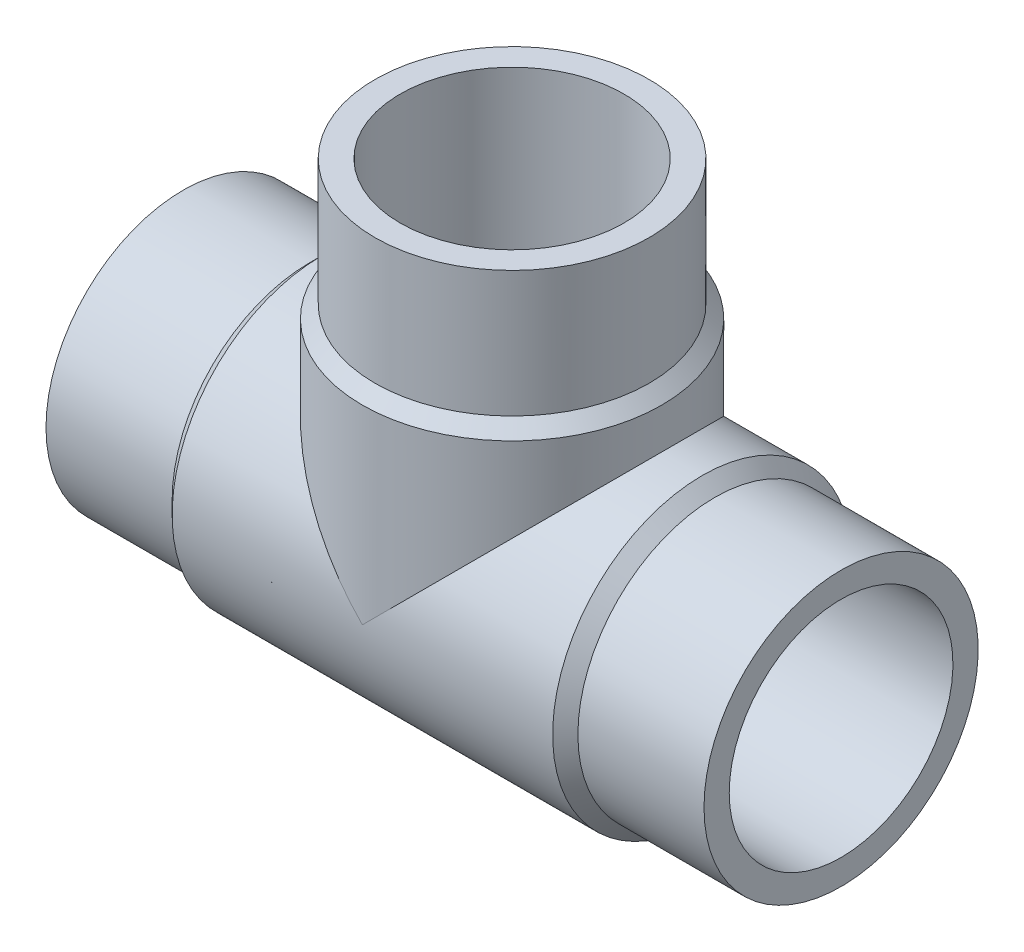
ISO-10303-21;
HEADER;
FILE_DESCRIPTION(('STEP AP214'),'2;1');
FILE_NAME('part.step','',(''),(''),'','','');
FILE_SCHEMA(('AUTOMOTIVE_DESIGN { 1 0 10303 214 1 1 1 1 }'));
ENDSEC;
DATA;
#1=APPLICATION_CONTEXT('core data for automotive mechanical design processes');
#2=APPLICATION_PROTOCOL_DEFINITION('international standard','automotive_design',2000,#1);
#3=PRODUCT_CONTEXT('',#1,'mechanical');
#4=PRODUCT('Part','Part','',(#3));
#5=PRODUCT_RELATED_PRODUCT_CATEGORY('part','',(#4));
#6=PRODUCT_DEFINITION_FORMATION('','',#4);
#7=PRODUCT_DEFINITION_CONTEXT('part definition',#1,'design');
#8=PRODUCT_DEFINITION('design','',#6,#7);
#9=PRODUCT_DEFINITION_SHAPE('','',#8);
#10=(LENGTH_UNIT() NAMED_UNIT(*) SI_UNIT(.MILLI.,.METRE.));
#11=(NAMED_UNIT(*) PLANE_ANGLE_UNIT() SI_UNIT($,.RADIAN.));
#12=(NAMED_UNIT(*) SI_UNIT($,.STERADIAN.) SOLID_ANGLE_UNIT());
#13=UNCERTAINTY_MEASURE_WITH_UNIT(LENGTH_MEASURE(1.E-05),#10,'distance_accuracy_value','');
#14=(GEOMETRIC_REPRESENTATION_CONTEXT(3) GLOBAL_UNCERTAINTY_ASSIGNED_CONTEXT((#13)) GLOBAL_UNIT_ASSIGNED_CONTEXT((#10,
#11,#12)) REPRESENTATION_CONTEXT('',''));
#15=CARTESIAN_POINT('',(0.,0.,0.));
#16=DIRECTION('',(0.,0.,1.));
#17=DIRECTION('',(1.,0.,0.));
#18=AXIS2_PLACEMENT_3D('',#15,#16,#17);
#19=CARTESIAN_POINT('',(-60.,60.,0.));
#20=DIRECTION('',(0.,1.,0.));
#21=DIRECTION('',(0.,0.,1.));
#22=AXIS2_PLACEMENT_3D('',#19,#20,#21);
#23=CYLINDRICAL_SURFACE('',#22,25.);
#24=CARTESIAN_POINT('',(-60.,60.,0.));
#25=DIRECTION('',(0.,1.,0.));
#26=DIRECTION('',(0.,0.,1.));
#27=AXIS2_PLACEMENT_3D('',#24,#25,#26);
#28=CIRCLE('',#27,25.);
#29=CARTESIAN_POINT('',(-60.,60.,25.));
#30=VERTEX_POINT('',#29);
#31=EDGE_CURVE('E18',#30,#30,#28,.T.);
#32=ORIENTED_EDGE('',*,*,#31,.F.);
#33=EDGE_LOOP('',(#32));
#34=FACE_BOUND('',#33,.T.);
#35=CARTESIAN_POINT('',(-60.,37.,0.));
#36=DIRECTION('',(0.,1.,0.));
#37=DIRECTION('',(1.,0.,0.));
#38=AXIS2_PLACEMENT_3D('',#35,#36,#37);
#39=CIRCLE('',#38,25.);
#40=CARTESIAN_POINT('',(-35.,37.,0.));
#41=VERTEX_POINT('',#40);
#42=EDGE_CURVE('E71',#41,#41,#39,.F.);
#43=ORIENTED_EDGE('',*,*,#42,.F.);
#44=EDGE_LOOP('',(#43));
#45=FACE_BOUND('',#44,.T.);
#46=ADVANCED_FACE('F15',(#34,#45),#23,.T.);
#47=CARTESIAN_POINT('',(-60.,37.,0.));
#48=DIRECTION('',(0.,-1.,0.));
#49=DIRECTION('',(0.,0.,-1.));
#50=AXIS2_PLACEMENT_3D('',#47,#48,#49);
#51=CONICAL_SURFACE('',#50,25.,0.785398163397448);
#52=CARTESIAN_POINT('',(-60.,34.7,0.));
#53=DIRECTION('',(0.,1.,0.));
#54=DIRECTION('',(1.,0.,0.));
#55=AXIS2_PLACEMENT_3D('',#52,#53,#54);
#56=CIRCLE('',#55,27.3);
#57=CARTESIAN_POINT('',(-32.7,34.7,0.));
#58=VERTEX_POINT('',#57);
#59=EDGE_CURVE('E60',#58,#58,#56,.F.);
#60=ORIENTED_EDGE('',*,*,#59,.F.);
#61=EDGE_LOOP('',(#60));
#62=FACE_BOUND('',#61,.T.);
#63=ORIENTED_EDGE('',*,*,#42,.T.);
#64=EDGE_LOOP('',(#63));
#65=FACE_BOUND('',#64,.T.);
#66=ADVANCED_FACE('F141',(#62,#65),#51,.T.);
#67=CARTESIAN_POINT('',(-23.,0.,0.));
#68=DIRECTION('',(-1.,0.,0.));
#69=DIRECTION('',(0.,0.,1.));
#70=AXIS2_PLACEMENT_3D('',#67,#68,#69);
#71=CYLINDRICAL_SURFACE('',#70,25.);
#72=CARTESIAN_POINT('',(-23.,0.,0.));
#73=DIRECTION('',(1.,0.,0.));
#74=DIRECTION('',(0.,1.,0.));
#75=AXIS2_PLACEMENT_3D('',#72,#73,#74);
#76=CIRCLE('',#75,25.);
#77=CARTESIAN_POINT('',(-23.,25.,0.));
#78=VERTEX_POINT('',#77);
#79=EDGE_CURVE('E64',#78,#78,#76,.F.);
#80=ORIENTED_EDGE('',*,*,#79,.F.);
#81=EDGE_LOOP('',(#80));
#82=FACE_BOUND('',#81,.T.);
#83=CARTESIAN_POINT('',(0.,0.,0.));
#84=DIRECTION('',(-1.,0.,0.));
#85=DIRECTION('',(0.,0.,1.));
#86=AXIS2_PLACEMENT_3D('',#83,#84,#85);
#87=CIRCLE('',#86,25.);
#88=CARTESIAN_POINT('',(0.,0.,25.));
#89=VERTEX_POINT('',#88);
#90=EDGE_CURVE('E58',#89,#89,#87,.F.);
#91=ORIENTED_EDGE('',*,*,#90,.F.);
#92=EDGE_LOOP('',(#91));
#93=FACE_BOUND('',#92,.T.);
#94=ADVANCED_FACE('F136',(#82,#93),#71,.T.);
#95=CARTESIAN_POINT('',(-85.,60.,25.3000021082717));
#96=DIRECTION('',(0.,1.,0.));
#97=DIRECTION('',(1.,0.,0.));
#98=AXIS2_PLACEMENT_3D('',#95,#96,#97);
#99=PLANE('',#98);
#100=CARTESIAN_POINT('',(-60.,60.,0.));
#101=DIRECTION('',(0.,1.,0.));
#102=DIRECTION('',(0.,0.,1.));
#103=AXIS2_PLACEMENT_3D('',#100,#101,#102);
#104=CIRCLE('',#103,20.4);
#105=CARTESIAN_POINT('',(-60.,60.,20.4));
#106=VERTEX_POINT('',#105);
#107=EDGE_CURVE('E52',#106,#106,#104,.T.);
#108=ORIENTED_EDGE('',*,*,#107,.F.);
#109=EDGE_LOOP('',(#108));
#110=FACE_BOUND('',#109,.T.);
#111=ORIENTED_EDGE('',*,*,#31,.T.);
#112=EDGE_LOOP('',(#111));
#113=FACE_BOUND('',#112,.T.);
#114=ADVANCED_FACE('F130',(#110,#113),#99,.T.);
#115=CARTESIAN_POINT('',(-23.,0.,0.));
#116=DIRECTION('',(-1.,0.,0.));
#117=DIRECTION('',(0.,0.,1.));
#118=AXIS2_PLACEMENT_3D('',#115,#116,#117);
#119=CONICAL_SURFACE('',#118,25.,0.785398163397452);
#120=ORIENTED_EDGE('',*,*,#79,.T.);
#121=EDGE_LOOP('',(#120));
#122=FACE_BOUND('',#121,.T.);
#123=CARTESIAN_POINT('',(-25.3,0.,0.));
#124=DIRECTION('',(-1.,0.,0.));
#125=DIRECTION('',(0.,1.,0.));
#126=AXIS2_PLACEMENT_3D('',#123,#124,#125);
#127=CIRCLE('',#126,27.3);
#128=CARTESIAN_POINT('',(-25.3,27.3,0.));
#129=VERTEX_POINT('',#128);
#130=EDGE_CURVE('E49',#129,#129,#127,.T.);
#131=ORIENTED_EDGE('',*,*,#130,.F.);
#132=EDGE_LOOP('',(#131));
#133=FACE_BOUND('',#132,.T.);
#134=ADVANCED_FACE('F95',(#122,#133),#119,.T.);
#135=CARTESIAN_POINT('',(-60.,34.7,0.));
#136=DIRECTION('',(0.,1.,0.));
#137=DIRECTION('',(0.,0.,1.));
#138=AXIS2_PLACEMENT_3D('',#135,#136,#137);
#139=CYLINDRICAL_SURFACE('',#138,27.3);
#140=CARTESIAN_POINT('',(-60.,0.,0.));
#141=DIRECTION('',(0.707106781186547,0.707106781186547,0.));
#142=DIRECTION('',(-0.707106781186547,0.707106781186547,0.));
#143=AXIS2_PLACEMENT_3D('',#140,#141,#142);
#144=ELLIPSE('',#143,38.6080302527855,27.3);
#145=CARTESIAN_POINT('',(-60.,0.,27.3));
#146=VERTEX_POINT('',#145);
#147=CARTESIAN_POINT('',(-60.,0.,-27.3));
#148=VERTEX_POINT('',#147);
#149=EDGE_CURVE('E44',#146,#148,#144,.F.);
#150=ORIENTED_EDGE('',*,*,#149,.F.);
#151=CARTESIAN_POINT('',(-60.,0.,0.));
#152=DIRECTION('',(-0.707106781186547,0.707106781186547,0.));
#153=DIRECTION('',(-0.707106781186547,-0.707106781186547,0.));
#154=AXIS2_PLACEMENT_3D('',#151,#152,#153);
#155=ELLIPSE('',#154,38.6080302527855,27.3);
#156=EDGE_CURVE('E40',#148,#146,#155,.F.);
#157=ORIENTED_EDGE('',*,*,#156,.F.);
#158=EDGE_LOOP('',(#150,#157));
#159=FACE_BOUND('',#158,.T.);
#160=ORIENTED_EDGE('',*,*,#59,.T.);
#161=EDGE_LOOP('',(#160));
#162=FACE_BOUND('',#161,.T.);
#163=ADVANCED_FACE('F47',(#159,#162),#139,.T.);
#164=CARTESIAN_POINT('',(0.,25.,25.3000021083545));
#165=DIRECTION('',(1.,0.,0.));
#166=DIRECTION('',(0.,-1.,0.));
#167=AXIS2_PLACEMENT_3D('',#164,#165,#166);
#168=PLANE('',#167);
#169=CARTESIAN_POINT('',(0.,0.,0.));
#170=DIRECTION('',(-1.,0.,0.));
#171=DIRECTION('',(0.,0.,1.));
#172=AXIS2_PLACEMENT_3D('',#169,#170,#171);
#173=CIRCLE('',#172,20.4);
#174=CARTESIAN_POINT('',(0.,0.,20.4));
#175=VERTEX_POINT('',#174);
#176=EDGE_CURVE('E45',#175,#175,#173,.F.);
#177=ORIENTED_EDGE('',*,*,#176,.F.);
#178=EDGE_LOOP('',(#177));
#179=FACE_BOUND('',#178,.T.);
#180=ORIENTED_EDGE('',*,*,#90,.T.);
#181=EDGE_LOOP('',(#180));
#182=FACE_BOUND('',#181,.T.);
#183=ADVANCED_FACE('F85',(#179,#182),#168,.T.);
#184=CARTESIAN_POINT('',(-60.,0.,0.));
#185=DIRECTION('',(0.,1.,0.));
#186=DIRECTION('',(0.,0.,1.));
#187=AXIS2_PLACEMENT_3D('',#184,#185,#186);
#188=CYLINDRICAL_SURFACE('',#187,20.4);
#189=CARTESIAN_POINT('',(-60.,0.,0.));
#190=DIRECTION('',(-0.707106781186547,-0.707106781186548,0.));
#191=DIRECTION('',(-0.707106781186548,0.707106781186547,0.));
#192=AXIS2_PLACEMENT_3D('',#189,#190,#191);
#193=ELLIPSE('',#192,28.8499566724111,20.4);
#194=CARTESIAN_POINT('',(-60.,0.,-20.4));
#195=VERTEX_POINT('',#194);
#196=CARTESIAN_POINT('',(-60.,0.,20.4));
#197=VERTEX_POINT('',#196);
#198=EDGE_CURVE('E78',#195,#197,#193,.F.);
#199=ORIENTED_EDGE('',*,*,#198,.F.);
#200=CARTESIAN_POINT('',(-60.,0.,0.));
#201=DIRECTION('',(-0.707106781186547,0.707106781186547,0.));
#202=DIRECTION('',(0.707106781186547,0.707106781186547,0.));
#203=AXIS2_PLACEMENT_3D('',#200,#201,#202);
#204=ELLIPSE('',#203,28.8499566724111,20.4);
#205=EDGE_CURVE('E32',#195,#197,#204,.F.);
#206=ORIENTED_EDGE('',*,*,#205,.T.);
#207=EDGE_LOOP('',(#199,#206));
#208=FACE_BOUND('',#207,.T.);
#209=ORIENTED_EDGE('',*,*,#107,.T.);
#210=EDGE_LOOP('',(#209));
#211=FACE_BOUND('',#210,.T.);
#212=ADVANCED_FACE('F87',(#208,#211),#188,.F.);
#213=CARTESIAN_POINT('',(-94.7,0.,0.));
#214=DIRECTION('',(-1.,0.,0.));
#215=DIRECTION('',(0.,0.,1.));
#216=AXIS2_PLACEMENT_3D('',#213,#214,#215);
#217=CYLINDRICAL_SURFACE('',#216,27.3);
#218=ORIENTED_EDGE('',*,*,#130,.T.);
#219=EDGE_LOOP('',(#218));
#220=FACE_BOUND('',#219,.T.);
#221=CARTESIAN_POINT('',(-94.7,0.,0.));
#222=DIRECTION('',(-1.,0.,0.));
#223=DIRECTION('',(0.,1.,0.));
#224=AXIS2_PLACEMENT_3D('',#221,#222,#223);
#225=CIRCLE('',#224,27.3);
#226=CARTESIAN_POINT('',(-94.7,27.3,0.));
#227=VERTEX_POINT('',#226);
#228=EDGE_CURVE('E77',#227,#227,#225,.T.);
#229=ORIENTED_EDGE('',*,*,#228,.F.);
#230=EDGE_LOOP('',(#229));
#231=FACE_BOUND('',#230,.T.);
#232=ORIENTED_EDGE('',*,*,#149,.T.);
#233=ORIENTED_EDGE('',*,*,#156,.T.);
#234=EDGE_LOOP('',(#232,#233));
#235=FACE_BOUND('',#234,.T.);
#236=ADVANCED_FACE('F43',(#220,#231,#235),#217,.T.);
#237=CARTESIAN_POINT('',(-60.,0.,0.));
#238=DIRECTION('',(-1.,0.,0.));
#239=DIRECTION('',(0.,-1.,0.));
#240=AXIS2_PLACEMENT_3D('',#237,#238,#239);
#241=CYLINDRICAL_SURFACE('',#240,20.4);
#242=ORIENTED_EDGE('',*,*,#205,.F.);
#243=ORIENTED_EDGE('',*,*,#198,.T.);
#244=EDGE_LOOP('',(#242,#243));
#245=FACE_BOUND('',#244,.T.);
#246=ORIENTED_EDGE('',*,*,#176,.T.);
#247=EDGE_LOOP('',(#246));
#248=FACE_BOUND('',#247,.T.);
#249=CARTESIAN_POINT('',(-120.,0.,0.));
#250=DIRECTION('',(-1.,0.,0.));
#251=DIRECTION('',(0.,-1.,0.));
#252=AXIS2_PLACEMENT_3D('',#249,#250,#251);
#253=CIRCLE('',#252,20.4);
#254=CARTESIAN_POINT('',(-120.,-20.4,0.));
#255=VERTEX_POINT('',#254);
#256=EDGE_CURVE('E74',#255,#255,#253,.F.);
#257=ORIENTED_EDGE('',*,*,#256,.F.);
#258=EDGE_LOOP('',(#257));
#259=FACE_BOUND('',#258,.T.);
#260=ADVANCED_FACE('F82',(#245,#248,#259),#241,.F.);
#261=CARTESIAN_POINT('',(-97.,0.,0.));
#262=DIRECTION('',(1.,0.,0.));
#263=DIRECTION('',(0.,0.,-1.));
#264=AXIS2_PLACEMENT_3D('',#261,#262,#263);
#265=CONICAL_SURFACE('',#264,25.,0.785398163397451);
#266=ORIENTED_EDGE('',*,*,#228,.T.);
#267=EDGE_LOOP('',(#266));
#268=FACE_BOUND('',#267,.T.);
#269=CARTESIAN_POINT('',(-97.,0.,0.));
#270=DIRECTION('',(-1.,0.,0.));
#271=DIRECTION('',(0.,1.,0.));
#272=AXIS2_PLACEMENT_3D('',#269,#270,#271);
#273=CIRCLE('',#272,25.);
#274=CARTESIAN_POINT('',(-97.,25.,0.));
#275=VERTEX_POINT('',#274);
#276=EDGE_CURVE('E24',#275,#275,#273,.T.);
#277=ORIENTED_EDGE('',*,*,#276,.F.);
#278=EDGE_LOOP('',(#277));
#279=FACE_BOUND('',#278,.T.);
#280=ADVANCED_FACE('F105',(#268,#279),#265,.T.);
#281=CARTESIAN_POINT('',(-120.,-25.,25.3000021084363));
#282=DIRECTION('',(-1.,0.,0.));
#283=DIRECTION('',(0.,1.,0.));
#284=AXIS2_PLACEMENT_3D('',#281,#282,#283);
#285=PLANE('',#284);
#286=ORIENTED_EDGE('',*,*,#256,.T.);
#287=EDGE_LOOP('',(#286));
#288=FACE_BOUND('',#287,.T.);
#289=CARTESIAN_POINT('',(-120.,0.,0.));
#290=DIRECTION('',(-1.,0.,0.));
#291=DIRECTION('',(0.,0.,1.));
#292=AXIS2_PLACEMENT_3D('',#289,#290,#291);
#293=CIRCLE('',#292,25.);
#294=CARTESIAN_POINT('',(-120.,0.,25.));
#295=VERTEX_POINT('',#294);
#296=EDGE_CURVE('E9',#295,#295,#293,.F.);
#297=ORIENTED_EDGE('',*,*,#296,.F.);
#298=EDGE_LOOP('',(#297));
#299=FACE_BOUND('',#298,.T.);
#300=ADVANCED_FACE('F99',(#288,#299),#285,.T.);
#301=CARTESIAN_POINT('',(-120.,0.,0.));
#302=DIRECTION('',(-1.,0.,0.));
#303=DIRECTION('',(0.,0.,1.));
#304=AXIS2_PLACEMENT_3D('',#301,#302,#303);
#305=CYLINDRICAL_SURFACE('',#304,25.);
#306=ORIENTED_EDGE('',*,*,#276,.T.);
#307=EDGE_LOOP('',(#306));
#308=FACE_BOUND('',#307,.T.);
#309=ORIENTED_EDGE('',*,*,#296,.T.);
#310=EDGE_LOOP('',(#309));
#311=FACE_BOUND('',#310,.T.);
#312=ADVANCED_FACE('F97',(#308,#311),#305,.T.);
#313=CLOSED_SHELL('',(#46,#66,#94,#114,#134,#163,#183,#212,#236,#260,#280,#300,#312));
#314=MANIFOLD_SOLID_BREP('B1',#313);
#315=ADVANCED_BREP_SHAPE_REPRESENTATION('',(#18,#314),#14);
#316=SHAPE_DEFINITION_REPRESENTATION(#9,#315);
ENDSEC;
END-ISO-10303-21;
